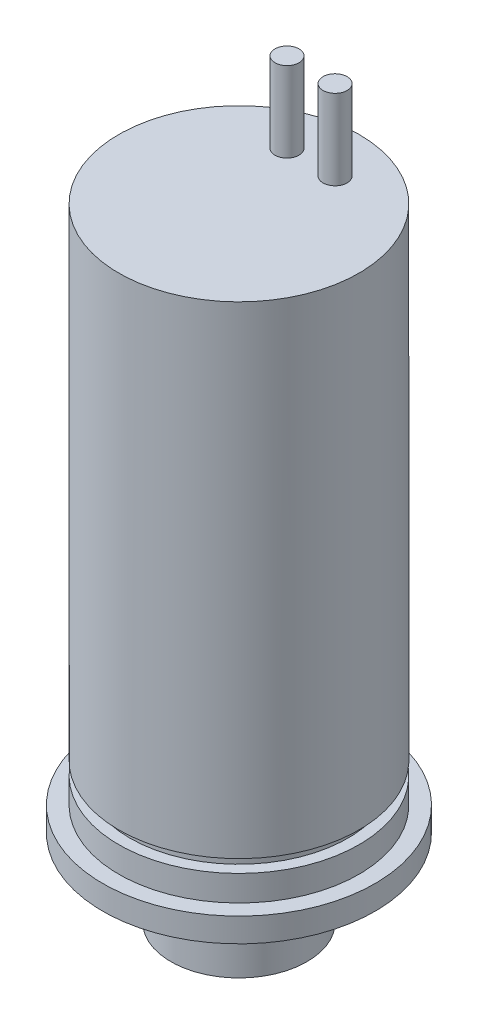
ISO-10303-21;
HEADER;
FILE_DESCRIPTION(('STEP AP214'),'2;1');
FILE_NAME('part.step','',(''),(''),'','','');
FILE_SCHEMA(('AUTOMOTIVE_DESIGN { 1 0 10303 214 1 1 1 1 }'));
ENDSEC;
DATA;
#1=APPLICATION_CONTEXT('core data for automotive mechanical design processes');
#2=APPLICATION_PROTOCOL_DEFINITION('international standard','automotive_design',2000,#1);
#3=PRODUCT_CONTEXT('',#1,'mechanical');
#4=PRODUCT('Part','Part','',(#3));
#5=PRODUCT_RELATED_PRODUCT_CATEGORY('part','',(#4));
#6=PRODUCT_DEFINITION_FORMATION('','',#4);
#7=PRODUCT_DEFINITION_CONTEXT('part definition',#1,'design');
#8=PRODUCT_DEFINITION('design','',#6,#7);
#9=PRODUCT_DEFINITION_SHAPE('','',#8);
#10=(LENGTH_UNIT() NAMED_UNIT(*) SI_UNIT(.MILLI.,.METRE.));
#11=(NAMED_UNIT(*) PLANE_ANGLE_UNIT() SI_UNIT($,.RADIAN.));
#12=(NAMED_UNIT(*) SI_UNIT($,.STERADIAN.) SOLID_ANGLE_UNIT());
#13=UNCERTAINTY_MEASURE_WITH_UNIT(LENGTH_MEASURE(1.E-05),#10,'distance_accuracy_value','');
#14=(GEOMETRIC_REPRESENTATION_CONTEXT(3) GLOBAL_UNCERTAINTY_ASSIGNED_CONTEXT((#13)) GLOBAL_UNIT_ASSIGNED_CONTEXT((#10,
#11,#12)) REPRESENTATION_CONTEXT('',''));
#15=CARTESIAN_POINT('',(0.,0.,0.));
#16=DIRECTION('',(0.,0.,1.));
#17=DIRECTION('',(1.,0.,0.));
#18=AXIS2_PLACEMENT_3D('',#15,#16,#17);
#19=CARTESIAN_POINT('',(-4.25,5.5,0.));
#20=DIRECTION('',(0.,1.,0.));
#21=DIRECTION('',(0.,0.,1.));
#22=AXIS2_PLACEMENT_3D('',#19,#20,#21);
#23=PLANE('',#22);
#24=CARTESIAN_POINT('',(0.,5.5,0.));
#25=DIRECTION('',(0.,-1.,0.));
#26=DIRECTION('',(0.,0.,-1.));
#27=AXIS2_PLACEMENT_3D('',#24,#25,#26);
#28=CIRCLE('',#27,8.5);
#29=CARTESIAN_POINT('',(0.,5.5,-8.5));
#30=VERTEX_POINT('',#29);
#31=EDGE_CURVE('E115',#30,#30,#28,.T.);
#32=ORIENTED_EDGE('',*,*,#31,.T.);
#33=EDGE_LOOP('',(#32));
#34=FACE_BOUND('',#33,.T.);
#35=CARTESIAN_POINT('',(0.,5.5,0.));
#36=DIRECTION('',(0.,-1.,0.));
#37=DIRECTION('',(0.,0.,-1.));
#38=AXIS2_PLACEMENT_3D('',#35,#36,#37);
#39=CIRCLE('',#38,7.63);
#40=CARTESIAN_POINT('',(0.,5.5,-7.63));
#41=VERTEX_POINT('',#40);
#42=EDGE_CURVE('E65',#41,#41,#39,.T.);
#43=ORIENTED_EDGE('',*,*,#42,.F.);
#44=EDGE_LOOP('',(#43));
#45=FACE_BOUND('',#44,.T.);
#46=ADVANCED_FACE('F43',(#34,#45),#23,.F.);
#47=CARTESIAN_POINT('',(0.,0.,0.));
#48=DIRECTION('',(0.,-1.,0.));
#49=DIRECTION('',(0.,0.,-1.));
#50=AXIS2_PLACEMENT_3D('',#47,#48,#49);
#51=CYLINDRICAL_SURFACE('',#50,8.5);
#52=ORIENTED_EDGE('',*,*,#31,.F.);
#53=EDGE_LOOP('',(#52));
#54=FACE_BOUND('',#53,.T.);
#55=CARTESIAN_POINT('',(0.,7.,0.));
#56=DIRECTION('',(0.,-1.,0.));
#57=DIRECTION('',(0.,0.,-1.));
#58=AXIS2_PLACEMENT_3D('',#55,#56,#57);
#59=CIRCLE('',#58,8.5);
#60=CARTESIAN_POINT('',(0.,7.,-8.5));
#61=VERTEX_POINT('',#60);
#62=EDGE_CURVE('E112',#61,#61,#59,.T.);
#63=ORIENTED_EDGE('',*,*,#62,.T.);
#64=EDGE_LOOP('',(#63));
#65=FACE_BOUND('',#64,.T.);
#66=ADVANCED_FACE('F150',(#54,#65),#51,.T.);
#67=CARTESIAN_POINT('',(-8.5,7.,0.));
#68=DIRECTION('',(0.,-1.,0.));
#69=DIRECTION('',(0.,0.,-1.));
#70=AXIS2_PLACEMENT_3D('',#67,#68,#69);
#71=PLANE('',#70);
#72=ORIENTED_EDGE('',*,*,#62,.F.);
#73=EDGE_LOOP('',(#72));
#74=FACE_BOUND('',#73,.T.);
#75=CARTESIAN_POINT('',(0.,7.,0.));
#76=DIRECTION('',(0.,-1.,0.));
#77=DIRECTION('',(0.,0.,-1.));
#78=AXIS2_PLACEMENT_3D('',#75,#76,#77);
#79=CIRCLE('',#78,7.5);
#80=CARTESIAN_POINT('',(0.,7.,-7.5));
#81=VERTEX_POINT('',#80);
#82=EDGE_CURVE('E109',#81,#81,#79,.T.);
#83=ORIENTED_EDGE('',*,*,#82,.T.);
#84=EDGE_LOOP('',(#83));
#85=FACE_BOUND('',#84,.T.);
#86=ADVANCED_FACE('F156',(#74,#85),#71,.F.);
#87=CARTESIAN_POINT('',(0.,0.,0.));
#88=DIRECTION('',(0.,-1.,0.));
#89=DIRECTION('',(0.,0.,-1.));
#90=AXIS2_PLACEMENT_3D('',#87,#88,#89);
#91=CYLINDRICAL_SURFACE('',#90,7.5);
#92=CARTESIAN_POINT('',(0.,8.6,0.));
#93=DIRECTION('',(0.,-1.,0.));
#94=DIRECTION('',(0.,0.,-1.));
#95=AXIS2_PLACEMENT_3D('',#92,#93,#94);
#96=CIRCLE('',#95,7.5);
#97=CARTESIAN_POINT('',(0.,8.6,-7.5));
#98=VERTEX_POINT('',#97);
#99=EDGE_CURVE('E59',#98,#98,#96,.T.);
#100=ORIENTED_EDGE('',*,*,#99,.T.);
#101=EDGE_LOOP('',(#100));
#102=FACE_BOUND('',#101,.T.);
#103=ORIENTED_EDGE('',*,*,#82,.F.);
#104=EDGE_LOOP('',(#103));
#105=FACE_BOUND('',#104,.T.);
#106=ADVANCED_FACE('F145',(#102,#105),#91,.T.);
#107=CARTESIAN_POINT('',(0.,0.,0.));
#108=DIRECTION('',(0.,-1.,0.));
#109=DIRECTION('',(0.,0.,-1.));
#110=AXIS2_PLACEMENT_3D('',#107,#108,#109);
#111=CYLINDRICAL_SURFACE('',#110,7.63);
#112=CARTESIAN_POINT('',(0.,6.4,0.));
#113=DIRECTION('',(0.,-1.,0.));
#114=DIRECTION('',(0.,0.,-1.));
#115=AXIS2_PLACEMENT_3D('',#112,#113,#114);
#116=CIRCLE('',#115,7.63);
#117=CARTESIAN_POINT('',(0.,6.4,-7.63));
#118=VERTEX_POINT('',#117);
#119=EDGE_CURVE('E82',#118,#118,#116,.T.);
#120=ORIENTED_EDGE('',*,*,#119,.F.);
#121=EDGE_LOOP('',(#120));
#122=FACE_BOUND('',#121,.T.);
#123=ORIENTED_EDGE('',*,*,#42,.T.);
#124=EDGE_LOOP('',(#123));
#125=FACE_BOUND('',#124,.T.);
#126=ADVANCED_FACE('F139',(#122,#125),#111,.F.);
#127=CARTESIAN_POINT('',(0.,6.4,-7.63));
#128=DIRECTION('',(0.,1.,0.));
#129=DIRECTION('',(0.,0.,1.));
#130=AXIS2_PLACEMENT_3D('',#127,#128,#129);
#131=PLANE('',#130);
#132=CARTESIAN_POINT('',(0.,6.4,0.));
#133=DIRECTION('',(0.,-1.,0.));
#134=DIRECTION('',(0.,0.,-1.));
#135=AXIS2_PLACEMENT_3D('',#132,#133,#134);
#136=CIRCLE('',#135,6.5);
#137=CARTESIAN_POINT('',(0.,6.4,-6.5));
#138=VERTEX_POINT('',#137);
#139=EDGE_CURVE('E79',#138,#138,#136,.T.);
#140=ORIENTED_EDGE('',*,*,#139,.F.);
#141=EDGE_LOOP('',(#140));
#142=FACE_BOUND('',#141,.T.);
#143=ORIENTED_EDGE('',*,*,#119,.T.);
#144=EDGE_LOOP('',(#143));
#145=FACE_BOUND('',#144,.T.);
#146=ADVANCED_FACE('F133',(#142,#145),#131,.F.);
#147=CARTESIAN_POINT('',(0.,0.,0.));
#148=DIRECTION('',(0.,-1.,0.));
#149=DIRECTION('',(0.,0.,-1.));
#150=AXIS2_PLACEMENT_3D('',#147,#148,#149);
#151=CYLINDRICAL_SURFACE('',#150,6.5);
#152=CARTESIAN_POINT('',(0.,5.5,0.));
#153=DIRECTION('',(0.,-1.,0.));
#154=DIRECTION('',(0.,0.,-1.));
#155=AXIS2_PLACEMENT_3D('',#152,#153,#154);
#156=CIRCLE('',#155,6.5);
#157=CARTESIAN_POINT('',(0.,5.5,-6.5));
#158=VERTEX_POINT('',#157);
#159=EDGE_CURVE('E76',#158,#158,#156,.T.);
#160=ORIENTED_EDGE('',*,*,#159,.F.);
#161=EDGE_LOOP('',(#160));
#162=FACE_BOUND('',#161,.T.);
#163=ORIENTED_EDGE('',*,*,#139,.T.);
#164=EDGE_LOOP('',(#163));
#165=FACE_BOUND('',#164,.T.);
#166=ADVANCED_FACE('F129',(#162,#165),#151,.T.);
#167=CARTESIAN_POINT('',(0.,7.5,0.));
#168=DIRECTION('',(0.,-1.,0.));
#169=DIRECTION('',(0.,0.,-1.));
#170=AXIS2_PLACEMENT_3D('',#167,#168,#169);
#171=PLANE('',#170);
#172=CARTESIAN_POINT('',(0.,7.5,0.));
#173=DIRECTION('',(0.,-1.,0.));
#174=DIRECTION('',(0.,0.,-1.));
#175=AXIS2_PLACEMENT_3D('',#172,#173,#174);
#176=CIRCLE('',#175,1.17);
#177=CARTESIAN_POINT('',(0.,7.5,-1.17));
#178=VERTEX_POINT('',#177);
#179=EDGE_CURVE('E86',#178,#178,#176,.T.);
#180=ORIENTED_EDGE('',*,*,#179,.T.);
#181=EDGE_LOOP('',(#180));
#182=FACE_BOUND('',#181,.T.);
#183=ADVANCED_FACE('F132',(#182),#171,.T.);
#184=CARTESIAN_POINT('',(0.,7.5,0.));
#185=DIRECTION('',(0.,-1.,0.));
#186=DIRECTION('',(0.,0.,-1.));
#187=AXIS2_PLACEMENT_3D('',#184,#185,#186);
#188=CYLINDRICAL_SURFACE('',#187,1.17);
#189=ORIENTED_EDGE('',*,*,#179,.F.);
#190=EDGE_LOOP('',(#189));
#191=FACE_BOUND('',#190,.T.);
#192=CARTESIAN_POINT('',(0.,0.,0.));
#193=DIRECTION('',(0.,-1.,0.));
#194=DIRECTION('',(0.,0.,-1.));
#195=AXIS2_PLACEMENT_3D('',#192,#193,#194);
#196=CIRCLE('',#195,1.17);
#197=CARTESIAN_POINT('',(0.,0.,-1.17));
#198=VERTEX_POINT('',#197);
#199=EDGE_CURVE('E85',#198,#198,#196,.T.);
#200=ORIENTED_EDGE('',*,*,#199,.T.);
#201=EDGE_LOOP('',(#200));
#202=FACE_BOUND('',#201,.T.);
#203=ADVANCED_FACE('F248',(#191,#202),#188,.F.);
#204=CARTESIAN_POINT('',(0.,0.,0.));
#205=DIRECTION('',(0.,1.,0.));
#206=DIRECTION('',(0.,0.,1.));
#207=AXIS2_PLACEMENT_3D('',#204,#205,#206);
#208=PLANE('',#207);
#209=ORIENTED_EDGE('',*,*,#199,.F.);
#210=EDGE_LOOP('',(#209));
#211=FACE_BOUND('',#210,.T.);
#212=CARTESIAN_POINT('',(0.,0.,0.));
#213=DIRECTION('',(0.,-1.,0.));
#214=DIRECTION('',(0.,0.,-1.));
#215=AXIS2_PLACEMENT_3D('',#212,#213,#214);
#216=CIRCLE('',#215,3.26);
#217=CARTESIAN_POINT('',(0.,0.,-3.26));
#218=VERTEX_POINT('',#217);
#219=EDGE_CURVE('E89',#218,#218,#216,.T.);
#220=ORIENTED_EDGE('',*,*,#219,.T.);
#221=EDGE_LOOP('',(#220));
#222=FACE_BOUND('',#221,.T.);
#223=ADVANCED_FACE('F45',(#211,#222),#208,.F.);
#224=CARTESIAN_POINT('',(0.,0.,0.));
#225=DIRECTION('',(0.,-1.,0.));
#226=DIRECTION('',(0.,0.,-1.));
#227=AXIS2_PLACEMENT_3D('',#224,#225,#226);
#228=CYLINDRICAL_SURFACE('',#227,3.26);
#229=ORIENTED_EDGE('',*,*,#219,.F.);
#230=EDGE_LOOP('',(#229));
#231=FACE_BOUND('',#230,.T.);
#232=CARTESIAN_POINT('',(0.,0.65,0.));
#233=DIRECTION('',(0.,-1.,0.));
#234=DIRECTION('',(0.,0.,-1.));
#235=AXIS2_PLACEMENT_3D('',#232,#233,#234);
#236=CIRCLE('',#235,3.26);
#237=CARTESIAN_POINT('',(0.,0.65,-3.26));
#238=VERTEX_POINT('',#237);
#239=EDGE_CURVE('E94',#238,#238,#236,.T.);
#240=ORIENTED_EDGE('',*,*,#239,.T.);
#241=EDGE_LOOP('',(#240));
#242=FACE_BOUND('',#241,.T.);
#243=ADVANCED_FACE('F167',(#231,#242),#228,.T.);
#244=CARTESIAN_POINT('',(0.,0.65,-4.25));
#245=DIRECTION('',(0.,1.,0.));
#246=DIRECTION('',(0.,0.,1.));
#247=AXIS2_PLACEMENT_3D('',#244,#245,#246);
#248=PLANE('',#247);
#249=ORIENTED_EDGE('',*,*,#239,.F.);
#250=EDGE_LOOP('',(#249));
#251=FACE_BOUND('',#250,.T.);
#252=CARTESIAN_POINT('',(0.,0.65,0.));
#253=DIRECTION('',(0.,-1.,0.));
#254=DIRECTION('',(0.,0.,-1.));
#255=AXIS2_PLACEMENT_3D('',#252,#253,#254);
#256=CIRCLE('',#255,4.25);
#257=CARTESIAN_POINT('',(0.,0.65,-4.25));
#258=VERTEX_POINT('',#257);
#259=EDGE_CURVE('E97',#258,#258,#256,.T.);
#260=ORIENTED_EDGE('',*,*,#259,.T.);
#261=EDGE_LOOP('',(#260));
#262=FACE_BOUND('',#261,.T.);
#263=ADVANCED_FACE('F161',(#251,#262),#248,.F.);
#264=CARTESIAN_POINT('',(0.,0.,0.));
#265=DIRECTION('',(0.,-1.,0.));
#266=DIRECTION('',(0.,0.,-1.));
#267=AXIS2_PLACEMENT_3D('',#264,#265,#266);
#268=CYLINDRICAL_SURFACE('',#267,4.25);
#269=ORIENTED_EDGE('',*,*,#259,.F.);
#270=EDGE_LOOP('',(#269));
#271=FACE_BOUND('',#270,.T.);
#272=CARTESIAN_POINT('',(0.,5.5,0.));
#273=DIRECTION('',(0.,-1.,0.));
#274=DIRECTION('',(0.,0.,-1.));
#275=AXIS2_PLACEMENT_3D('',#272,#273,#274);
#276=CIRCLE('',#275,4.25);
#277=CARTESIAN_POINT('',(0.,5.5,-4.25));
#278=VERTEX_POINT('',#277);
#279=EDGE_CURVE('E56',#278,#278,#276,.T.);
#280=ORIENTED_EDGE('',*,*,#279,.T.);
#281=EDGE_LOOP('',(#280));
#282=FACE_BOUND('',#281,.T.);
#283=ADVANCED_FACE('F120',(#271,#282),#268,.T.);
#284=ORIENTED_EDGE('',*,*,#279,.F.);
#285=EDGE_LOOP('',(#284));
#286=FACE_BOUND('',#285,.T.);
#287=ORIENTED_EDGE('',*,*,#159,.T.);
#288=EDGE_LOOP('',(#287));
#289=FACE_BOUND('',#288,.T.);
#290=ADVANCED_FACE('F122',(#286,#289),#23,.F.);
#291=CARTESIAN_POINT('',(0.,9.4,-7.6));
#292=DIRECTION('',(0.,1.,0.));
#293=DIRECTION('',(0.,0.,1.));
#294=AXIS2_PLACEMENT_3D('',#291,#292,#293);
#295=PLANE('',#294);
#296=CARTESIAN_POINT('',(0.,9.4,0.));
#297=DIRECTION('',(0.,-1.,0.));
#298=DIRECTION('',(0.,0.,-1.));
#299=AXIS2_PLACEMENT_3D('',#296,#297,#298);
#300=CIRCLE('',#299,6.8);
#301=CARTESIAN_POINT('',(0.,9.4,-6.8));
#302=VERTEX_POINT('',#301);
#303=EDGE_CURVE('E61',#302,#302,#300,.T.);
#304=ORIENTED_EDGE('',*,*,#303,.F.);
#305=EDGE_LOOP('',(#304));
#306=FACE_BOUND('',#305,.T.);
#307=CARTESIAN_POINT('',(0.,9.4,0.));
#308=DIRECTION('',(0.,1.,0.));
#309=DIRECTION('',(0.,0.,1.));
#310=AXIS2_PLACEMENT_3D('',#307,#308,#309);
#311=CIRCLE('',#310,7.5);
#312=CARTESIAN_POINT('',(0.,9.4,7.5));
#313=VERTEX_POINT('',#312);
#314=EDGE_CURVE('E47',#313,#313,#311,.T.);
#315=ORIENTED_EDGE('',*,*,#314,.F.);
#316=EDGE_LOOP('',(#315));
#317=FACE_BOUND('',#316,.T.);
#318=ADVANCED_FACE('F125',(#306,#317),#295,.F.);
#319=CARTESIAN_POINT('',(0.,8.6,-7.6));
#320=DIRECTION('',(0.,-1.,0.));
#321=DIRECTION('',(0.,0.,-1.));
#322=AXIS2_PLACEMENT_3D('',#319,#320,#321);
#323=PLANE('',#322);
#324=CARTESIAN_POINT('',(0.,8.6,0.));
#325=DIRECTION('',(0.,-1.,0.));
#326=DIRECTION('',(0.,0.,-1.));
#327=AXIS2_PLACEMENT_3D('',#324,#325,#326);
#328=CIRCLE('',#327,6.8);
#329=CARTESIAN_POINT('',(0.,8.6,-6.8));
#330=VERTEX_POINT('',#329);
#331=EDGE_CURVE('E67',#330,#330,#328,.T.);
#332=ORIENTED_EDGE('',*,*,#331,.T.);
#333=EDGE_LOOP('',(#332));
#334=FACE_BOUND('',#333,.T.);
#335=ORIENTED_EDGE('',*,*,#99,.F.);
#336=EDGE_LOOP('',(#335));
#337=FACE_BOUND('',#336,.T.);
#338=ADVANCED_FACE('F317',(#334,#337),#323,.F.);
#339=CARTESIAN_POINT('',(0.,0.,0.));
#340=DIRECTION('',(0.,-1.,0.));
#341=DIRECTION('',(0.,0.,-1.));
#342=AXIS2_PLACEMENT_3D('',#339,#340,#341);
#343=CYLINDRICAL_SURFACE('',#342,6.8);
#344=ORIENTED_EDGE('',*,*,#331,.F.);
#345=EDGE_LOOP('',(#344));
#346=FACE_BOUND('',#345,.T.);
#347=ORIENTED_EDGE('',*,*,#303,.T.);
#348=EDGE_LOOP('',(#347));
#349=FACE_BOUND('',#348,.T.);
#350=ADVANCED_FACE('F195',(#346,#349),#343,.T.);
#351=CARTESIAN_POINT('',(-1.5,44.5,-4.5));
#352=DIRECTION('',(0.,1.,0.));
#353=DIRECTION('',(0.,0.,1.));
#354=AXIS2_PLACEMENT_3D('',#351,#352,#353);
#355=PLANE('',#354);
#356=CARTESIAN_POINT('',(-1.5,44.5,-4.5));
#357=DIRECTION('',(0.,1.,0.));
#358=DIRECTION('',(0.,0.,1.));
#359=AXIS2_PLACEMENT_3D('',#356,#357,#358);
#360=CIRCLE('',#359,0.75);
#361=CARTESIAN_POINT('',(-1.5,44.5,-3.75));
#362=VERTEX_POINT('',#361);
#363=EDGE_CURVE('E100',#362,#362,#360,.T.);
#364=ORIENTED_EDGE('',*,*,#363,.T.);
#365=EDGE_LOOP('',(#364));
#366=FACE_BOUND('',#365,.T.);
#367=ADVANCED_FACE('F183',(#366),#355,.T.);
#368=CARTESIAN_POINT('',(1.5,44.5,-4.5));
#369=DIRECTION('',(0.,1.,0.));
#370=DIRECTION('',(0.,0.,1.));
#371=AXIS2_PLACEMENT_3D('',#368,#369,#370);
#372=PLANE('',#371);
#373=CARTESIAN_POINT('',(1.5,44.5,-4.5));
#374=DIRECTION('',(0.,1.,0.));
#375=DIRECTION('',(0.,0.,1.));
#376=AXIS2_PLACEMENT_3D('',#373,#374,#375);
#377=CIRCLE('',#376,0.75);
#378=CARTESIAN_POINT('',(1.5,44.5,-3.75));
#379=VERTEX_POINT('',#378);
#380=EDGE_CURVE('E101',#379,#379,#377,.T.);
#381=ORIENTED_EDGE('',*,*,#380,.T.);
#382=EDGE_LOOP('',(#381));
#383=FACE_BOUND('',#382,.T.);
#384=ADVANCED_FACE('F180',(#383),#372,.T.);
#385=CARTESIAN_POINT('',(-1.5,44.5,-4.5));
#386=DIRECTION('',(0.,-1.,0.));
#387=DIRECTION('',(0.,0.,-1.));
#388=AXIS2_PLACEMENT_3D('',#385,#386,#387);
#389=CYLINDRICAL_SURFACE('',#388,0.75);
#390=ORIENTED_EDGE('',*,*,#363,.F.);
#391=EDGE_LOOP('',(#390));
#392=FACE_BOUND('',#391,.T.);
#393=CARTESIAN_POINT('',(-1.5,39.5,-4.5));
#394=DIRECTION('',(0.,-1.,0.));
#395=DIRECTION('',(0.,0.,-1.));
#396=AXIS2_PLACEMENT_3D('',#393,#394,#395);
#397=CIRCLE('',#396,0.75);
#398=CARTESIAN_POINT('',(-1.5,39.5,-5.25));
#399=VERTEX_POINT('',#398);
#400=EDGE_CURVE('E51',#399,#399,#397,.F.);
#401=ORIENTED_EDGE('',*,*,#400,.T.);
#402=EDGE_LOOP('',(#401));
#403=FACE_BOUND('',#402,.T.);
#404=ADVANCED_FACE('F182',(#392,#403),#389,.T.);
#405=CARTESIAN_POINT('',(1.5,44.5,-4.5));
#406=DIRECTION('',(0.,-1.,0.));
#407=DIRECTION('',(0.,0.,-1.));
#408=AXIS2_PLACEMENT_3D('',#405,#406,#407);
#409=CYLINDRICAL_SURFACE('',#408,0.75);
#410=ORIENTED_EDGE('',*,*,#380,.F.);
#411=EDGE_LOOP('',(#410));
#412=FACE_BOUND('',#411,.T.);
#413=CARTESIAN_POINT('',(1.5,39.5,-4.5));
#414=DIRECTION('',(0.,-1.,0.));
#415=DIRECTION('',(0.,0.,-1.));
#416=AXIS2_PLACEMENT_3D('',#413,#414,#415);
#417=CIRCLE('',#416,0.75);
#418=CARTESIAN_POINT('',(1.5,39.5,-5.25));
#419=VERTEX_POINT('',#418);
#420=EDGE_CURVE('E10',#419,#419,#417,.F.);
#421=ORIENTED_EDGE('',*,*,#420,.T.);
#422=EDGE_LOOP('',(#421));
#423=FACE_BOUND('',#422,.T.);
#424=ADVANCED_FACE('F185',(#412,#423),#409,.T.);
#425=CARTESIAN_POINT('',(-7.5,39.5,0.));
#426=DIRECTION('',(0.,-1.,0.));
#427=DIRECTION('',(0.,0.,-1.));
#428=AXIS2_PLACEMENT_3D('',#425,#426,#427);
#429=PLANE('',#428);
#430=ORIENTED_EDGE('',*,*,#420,.F.);
#431=EDGE_LOOP('',(#430));
#432=FACE_BOUND('',#431,.T.);
#433=ORIENTED_EDGE('',*,*,#400,.F.);
#434=EDGE_LOOP('',(#433));
#435=FACE_BOUND('',#434,.T.);
#436=CARTESIAN_POINT('',(0.,39.5,0.));
#437=DIRECTION('',(0.,-1.,0.));
#438=DIRECTION('',(0.,0.,-1.));
#439=AXIS2_PLACEMENT_3D('',#436,#437,#438);
#440=CIRCLE('',#439,7.5);
#441=CARTESIAN_POINT('',(0.,39.5,-7.5));
#442=VERTEX_POINT('',#441);
#443=EDGE_CURVE('E104',#442,#442,#440,.T.);
#444=ORIENTED_EDGE('',*,*,#443,.F.);
#445=EDGE_LOOP('',(#444));
#446=FACE_BOUND('',#445,.T.);
#447=ADVANCED_FACE('F188',(#432,#435,#446),#429,.F.);
#448=ORIENTED_EDGE('',*,*,#314,.T.);
#449=EDGE_LOOP('',(#448));
#450=FACE_BOUND('',#449,.T.);
#451=ORIENTED_EDGE('',*,*,#443,.T.);
#452=EDGE_LOOP('',(#451));
#453=FACE_BOUND('',#452,.T.);
#454=ADVANCED_FACE('F199',(#450,#453),#91,.T.);
#455=CLOSED_SHELL('',(#46,#66,#86,#106,#126,#146,#166,#183,#203,#223,#243,#263,#283,#290,#318,
#338,#350,#367,#384,#404,#424,#447,#454));
#456=MANIFOLD_SOLID_BREP('B2',#455);
#457=ADVANCED_BREP_SHAPE_REPRESENTATION('',(#18,#456),#14);
#458=SHAPE_DEFINITION_REPRESENTATION(#9,#457);
ENDSEC;
END-ISO-10303-21;
